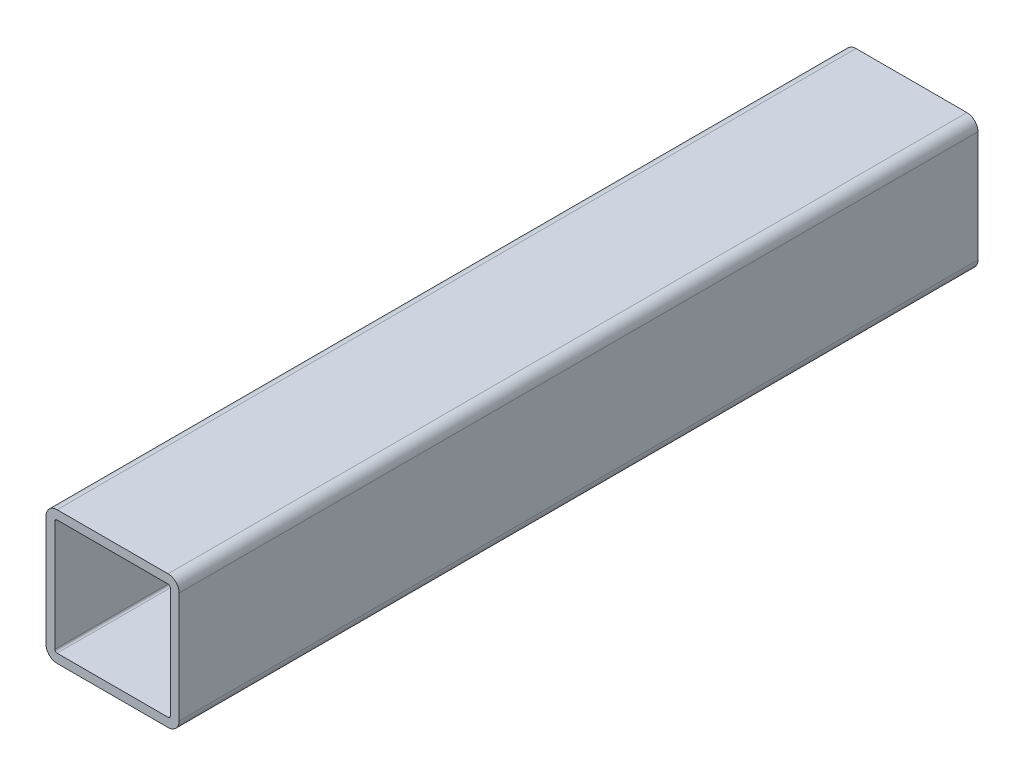
ISO-10303-21;
HEADER;
FILE_DESCRIPTION(('STEP AP214'),'2;1');
FILE_NAME('part.step','',(''),(''),'','','');
FILE_SCHEMA(('AUTOMOTIVE_DESIGN { 1 0 10303 214 1 1 1 1 }'));
ENDSEC;
DATA;
#1=APPLICATION_CONTEXT('core data for automotive mechanical design processes');
#2=APPLICATION_PROTOCOL_DEFINITION('international standard','automotive_design',2000,#1);
#3=PRODUCT_CONTEXT('',#1,'mechanical');
#4=PRODUCT('Part','Part','',(#3));
#5=PRODUCT_RELATED_PRODUCT_CATEGORY('part','',(#4));
#6=PRODUCT_DEFINITION_FORMATION('','',#4);
#7=PRODUCT_DEFINITION_CONTEXT('part definition',#1,'design');
#8=PRODUCT_DEFINITION('design','',#6,#7);
#9=PRODUCT_DEFINITION_SHAPE('','',#8);
#10=(LENGTH_UNIT() NAMED_UNIT(*) SI_UNIT(.MILLI.,.METRE.));
#11=(NAMED_UNIT(*) PLANE_ANGLE_UNIT() SI_UNIT($,.RADIAN.));
#12=(NAMED_UNIT(*) SI_UNIT($,.STERADIAN.) SOLID_ANGLE_UNIT());
#13=UNCERTAINTY_MEASURE_WITH_UNIT(LENGTH_MEASURE(1.E-05),#10,'distance_accuracy_value','');
#14=(GEOMETRIC_REPRESENTATION_CONTEXT(3) GLOBAL_UNCERTAINTY_ASSIGNED_CONTEXT((#13)) GLOBAL_UNIT_ASSIGNED_CONTEXT((#10,
#11,#12)) REPRESENTATION_CONTEXT('',''));
#15=CARTESIAN_POINT('',(0.,0.,0.));
#16=DIRECTION('',(0.,0.,1.));
#17=DIRECTION('',(1.,0.,0.));
#18=AXIS2_PLACEMENT_3D('',#15,#16,#17);
#19=CARTESIAN_POINT('',(-15.875,-15.875,114.3));
#20=DIRECTION('',(0.,0.,1.));
#21=DIRECTION('',(1.,0.,0.));
#22=AXIS2_PLACEMENT_3D('',#19,#20,#21);
#23=PLANE('',#22);
#24=CARTESIAN_POINT('',(-15.875,-15.875,114.3));
#25=DIRECTION('',(0.,0.,1.));
#26=DIRECTION('',(1.,0.,0.));
#27=AXIS2_PLACEMENT_3D('',#24,#25,#26);
#28=CIRCLE('',#27,3.175);
#29=CARTESIAN_POINT('',(-19.05,-15.875,114.3));
#30=VERTEX_POINT('',#29);
#31=CARTESIAN_POINT('',(-15.875,-19.05,114.3));
#32=VERTEX_POINT('',#31);
#33=EDGE_CURVE('E259',#30,#32,#28,.T.);
#34=ORIENTED_EDGE('',*,*,#33,.T.);
#35=DIRECTION('',(1.,0.,0.));
#36=VECTOR('',#35,1.);
#37=CARTESIAN_POINT('',(-15.875,-19.05,114.3));
#38=LINE('',#37,#36);
#39=CARTESIAN_POINT('',(15.875,-19.05,114.3));
#40=VERTEX_POINT('',#39);
#41=EDGE_CURVE('E262',#32,#40,#38,.T.);
#42=ORIENTED_EDGE('',*,*,#41,.T.);
#43=CARTESIAN_POINT('',(15.875,-15.875,114.3));
#44=DIRECTION('',(0.,0.,1.));
#45=DIRECTION('',(1.,0.,0.));
#46=AXIS2_PLACEMENT_3D('',#43,#44,#45);
#47=CIRCLE('',#46,3.175);
#48=CARTESIAN_POINT('',(19.05,-15.875,114.3));
#49=VERTEX_POINT('',#48);
#50=EDGE_CURVE('E265',#40,#49,#47,.T.);
#51=ORIENTED_EDGE('',*,*,#50,.T.);
#52=DIRECTION('',(0.,1.,0.));
#53=VECTOR('',#52,1.);
#54=CARTESIAN_POINT('',(19.05,15.875,114.3));
#55=LINE('',#54,#53);
#56=CARTESIAN_POINT('',(19.05,15.875,114.3));
#57=VERTEX_POINT('',#56);
#58=EDGE_CURVE('E267',#49,#57,#55,.T.);
#59=ORIENTED_EDGE('',*,*,#58,.T.);
#60=CARTESIAN_POINT('',(15.875,15.875,114.3));
#61=DIRECTION('',(0.,0.,1.));
#62=DIRECTION('',(1.,0.,0.));
#63=AXIS2_PLACEMENT_3D('',#60,#61,#62);
#64=CIRCLE('',#63,3.175);
#65=CARTESIAN_POINT('',(15.875,19.05,114.3));
#66=VERTEX_POINT('',#65);
#67=EDGE_CURVE('E269',#57,#66,#64,.T.);
#68=ORIENTED_EDGE('',*,*,#67,.T.);
#69=DIRECTION('',(-1.,0.,0.));
#70=VECTOR('',#69,1.);
#71=CARTESIAN_POINT('',(-15.875,19.05,114.3));
#72=LINE('',#71,#70);
#73=CARTESIAN_POINT('',(-15.875,19.05,114.3));
#74=VERTEX_POINT('',#73);
#75=EDGE_CURVE('E271',#66,#74,#72,.T.);
#76=ORIENTED_EDGE('',*,*,#75,.T.);
#77=CARTESIAN_POINT('',(-15.875,15.875,114.3));
#78=DIRECTION('',(0.,0.,1.));
#79=DIRECTION('',(1.,0.,0.));
#80=AXIS2_PLACEMENT_3D('',#77,#78,#79);
#81=CIRCLE('',#80,3.175);
#82=CARTESIAN_POINT('',(-19.05,15.875,114.3));
#83=VERTEX_POINT('',#82);
#84=EDGE_CURVE('E273',#74,#83,#81,.T.);
#85=ORIENTED_EDGE('',*,*,#84,.T.);
#86=DIRECTION('',(0.,-1.,0.));
#87=VECTOR('',#86,1.);
#88=CARTESIAN_POINT('',(-19.05,15.875,114.3));
#89=LINE('',#88,#87);
#90=EDGE_CURVE('E275',#83,#30,#89,.T.);
#91=ORIENTED_EDGE('',*,*,#90,.T.);
#92=EDGE_LOOP('',(#34,#42,#51,#59,#68,#76,#85,#91));
#93=FACE_BOUND('',#92,.T.);
#94=DIRECTION('',(1.,0.,0.));
#95=VECTOR('',#94,1.);
#96=CARTESIAN_POINT('',(-15.875,-16.51,114.3));
#97=LINE('',#96,#95);
#98=CARTESIAN_POINT('',(-15.875,-16.51,114.3));
#99=VERTEX_POINT('',#98);
#100=CARTESIAN_POINT('',(15.875,-16.51,114.3));
#101=VERTEX_POINT('',#100);
#102=EDGE_CURVE('E202',#99,#101,#97,.T.);
#103=ORIENTED_EDGE('',*,*,#102,.F.);
#104=CARTESIAN_POINT('',(-15.875,-15.875,114.3));
#105=DIRECTION('',(0.,0.,1.));
#106=DIRECTION('',(1.,0.,0.));
#107=AXIS2_PLACEMENT_3D('',#104,#105,#106);
#108=CIRCLE('',#107,0.635000000000002);
#109=CARTESIAN_POINT('',(-16.51,-15.875,114.3));
#110=VERTEX_POINT('',#109);
#111=EDGE_CURVE('E194',#110,#99,#108,.T.);
#112=ORIENTED_EDGE('',*,*,#111,.F.);
#113=DIRECTION('',(0.,-1.,0.));
#114=VECTOR('',#113,1.);
#115=CARTESIAN_POINT('',(-16.51,15.875,114.3));
#116=LINE('',#115,#114);
#117=CARTESIAN_POINT('',(-16.51,15.875,114.3));
#118=VERTEX_POINT('',#117);
#119=EDGE_CURVE('E227',#118,#110,#116,.T.);
#120=ORIENTED_EDGE('',*,*,#119,.F.);
#121=CARTESIAN_POINT('',(-15.875,15.875,114.3));
#122=DIRECTION('',(0.,0.,1.));
#123=DIRECTION('',(1.,0.,0.));
#124=AXIS2_PLACEMENT_3D('',#121,#122,#123);
#125=CIRCLE('',#124,0.635000000000004);
#126=CARTESIAN_POINT('',(-15.875,16.51,114.3));
#127=VERTEX_POINT('',#126);
#128=EDGE_CURVE('E225',#127,#118,#125,.T.);
#129=ORIENTED_EDGE('',*,*,#128,.F.);
#130=DIRECTION('',(-1.,0.,0.));
#131=VECTOR('',#130,1.);
#132=CARTESIAN_POINT('',(-15.875,16.51,114.3));
#133=LINE('',#132,#131);
#134=CARTESIAN_POINT('',(15.875,16.51,114.3));
#135=VERTEX_POINT('',#134);
#136=EDGE_CURVE('E223',#135,#127,#133,.T.);
#137=ORIENTED_EDGE('',*,*,#136,.F.);
#138=CARTESIAN_POINT('',(15.875,15.875,114.3));
#139=DIRECTION('',(0.,0.,1.));
#140=DIRECTION('',(1.,0.,0.));
#141=AXIS2_PLACEMENT_3D('',#138,#139,#140);
#142=CIRCLE('',#141,0.635000000000004);
#143=CARTESIAN_POINT('',(16.51,15.875,114.3));
#144=VERTEX_POINT('',#143);
#145=EDGE_CURVE('E221',#144,#135,#142,.T.);
#146=ORIENTED_EDGE('',*,*,#145,.F.);
#147=DIRECTION('',(0.,1.,0.));
#148=VECTOR('',#147,1.);
#149=CARTESIAN_POINT('',(16.51,15.875,114.3));
#150=LINE('',#149,#148);
#151=CARTESIAN_POINT('',(16.51,-15.875,114.3));
#152=VERTEX_POINT('',#151);
#153=EDGE_CURVE('E217',#152,#144,#150,.T.);
#154=ORIENTED_EDGE('',*,*,#153,.F.);
#155=CARTESIAN_POINT('',(15.875,-15.875,114.3));
#156=DIRECTION('',(0.,0.,1.));
#157=DIRECTION('',(1.,0.,0.));
#158=AXIS2_PLACEMENT_3D('',#155,#156,#157);
#159=CIRCLE('',#158,0.634999999999999);
#160=EDGE_CURVE('E215',#101,#152,#159,.T.);
#161=ORIENTED_EDGE('',*,*,#160,.F.);
#162=EDGE_LOOP('',(#103,#112,#120,#129,#137,#146,#154,#161));
#163=FACE_BOUND('',#162,.T.);
#164=ADVANCED_FACE('F81',(#93,#163),#23,.T.);
#165=CARTESIAN_POINT('',(-15.875,-15.875,-114.3));
#166=DIRECTION('',(0.,0.,1.));
#167=DIRECTION('',(1.,0.,0.));
#168=AXIS2_PLACEMENT_3D('',#165,#166,#167);
#169=PLANE('',#168);
#170=CARTESIAN_POINT('',(-15.875,-15.875,-114.3));
#171=DIRECTION('',(0.,0.,1.));
#172=DIRECTION('',(1.,0.,0.));
#173=AXIS2_PLACEMENT_3D('',#170,#171,#172);
#174=CIRCLE('',#173,3.175);
#175=CARTESIAN_POINT('',(-19.05,-15.875,-114.3));
#176=VERTEX_POINT('',#175);
#177=CARTESIAN_POINT('',(-15.875,-19.05,-114.3));
#178=VERTEX_POINT('',#177);
#179=EDGE_CURVE('E210',#176,#178,#174,.T.);
#180=ORIENTED_EDGE('',*,*,#179,.F.);
#181=DIRECTION('',(0.,-1.,0.));
#182=VECTOR('',#181,1.);
#183=CARTESIAN_POINT('',(-19.05,15.875,-114.3));
#184=LINE('',#183,#182);
#185=CARTESIAN_POINT('',(-19.05,15.875,-114.3));
#186=VERTEX_POINT('',#185);
#187=EDGE_CURVE('E263',#186,#176,#184,.T.);
#188=ORIENTED_EDGE('',*,*,#187,.F.);
#189=CARTESIAN_POINT('',(-15.875,15.875,-114.3));
#190=DIRECTION('',(0.,0.,1.));
#191=DIRECTION('',(1.,0.,0.));
#192=AXIS2_PLACEMENT_3D('',#189,#190,#191);
#193=CIRCLE('',#192,3.175);
#194=CARTESIAN_POINT('',(-15.875,19.05,-114.3));
#195=VERTEX_POINT('',#194);
#196=EDGE_CURVE('E290',#195,#186,#193,.T.);
#197=ORIENTED_EDGE('',*,*,#196,.F.);
#198=DIRECTION('',(-1.,0.,0.));
#199=VECTOR('',#198,1.);
#200=CARTESIAN_POINT('',(-15.875,19.05,-114.3));
#201=LINE('',#200,#199);
#202=CARTESIAN_POINT('',(15.875,19.05,-114.3));
#203=VERTEX_POINT('',#202);
#204=EDGE_CURVE('E288',#203,#195,#201,.T.);
#205=ORIENTED_EDGE('',*,*,#204,.F.);
#206=CARTESIAN_POINT('',(15.875,15.875,-114.3));
#207=DIRECTION('',(0.,0.,1.));
#208=DIRECTION('',(1.,0.,0.));
#209=AXIS2_PLACEMENT_3D('',#206,#207,#208);
#210=CIRCLE('',#209,3.175);
#211=CARTESIAN_POINT('',(19.05,15.875,-114.3));
#212=VERTEX_POINT('',#211);
#213=EDGE_CURVE('E286',#212,#203,#210,.T.);
#214=ORIENTED_EDGE('',*,*,#213,.F.);
#215=DIRECTION('',(0.,1.,0.));
#216=VECTOR('',#215,1.);
#217=CARTESIAN_POINT('',(19.05,15.875,-114.3));
#218=LINE('',#217,#216);
#219=CARTESIAN_POINT('',(19.05,-15.875,-114.3));
#220=VERTEX_POINT('',#219);
#221=EDGE_CURVE('E284',#220,#212,#218,.T.);
#222=ORIENTED_EDGE('',*,*,#221,.F.);
#223=CARTESIAN_POINT('',(15.875,-15.875,-114.3));
#224=DIRECTION('',(0.,0.,1.));
#225=DIRECTION('',(1.,0.,0.));
#226=AXIS2_PLACEMENT_3D('',#223,#224,#225);
#227=CIRCLE('',#226,3.175);
#228=CARTESIAN_POINT('',(15.875,-19.05,-114.3));
#229=VERTEX_POINT('',#228);
#230=EDGE_CURVE('E282',#229,#220,#227,.T.);
#231=ORIENTED_EDGE('',*,*,#230,.F.);
#232=DIRECTION('',(1.,0.,0.));
#233=VECTOR('',#232,1.);
#234=CARTESIAN_POINT('',(-15.875,-19.05,-114.3));
#235=LINE('',#234,#233);
#236=EDGE_CURVE('E280',#178,#229,#235,.T.);
#237=ORIENTED_EDGE('',*,*,#236,.F.);
#238=EDGE_LOOP('',(#180,#188,#197,#205,#214,#222,#231,#237));
#239=FACE_BOUND('',#238,.T.);
#240=CARTESIAN_POINT('',(-15.875,-15.875,-114.3));
#241=DIRECTION('',(0.,0.,1.));
#242=DIRECTION('',(1.,0.,0.));
#243=AXIS2_PLACEMENT_3D('',#240,#241,#242);
#244=CIRCLE('',#243,0.635000000000002);
#245=CARTESIAN_POINT('',(-16.51,-15.875,-114.3));
#246=VERTEX_POINT('',#245);
#247=CARTESIAN_POINT('',(-15.875,-16.51,-114.3));
#248=VERTEX_POINT('',#247);
#249=EDGE_CURVE('E104',#246,#248,#244,.T.);
#250=ORIENTED_EDGE('',*,*,#249,.T.);
#251=DIRECTION('',(1.,0.,0.));
#252=VECTOR('',#251,1.);
#253=CARTESIAN_POINT('',(-15.875,-16.51,-114.3));
#254=LINE('',#253,#252);
#255=CARTESIAN_POINT('',(15.875,-16.51,-114.3));
#256=VERTEX_POINT('',#255);
#257=EDGE_CURVE('E209',#248,#256,#254,.T.);
#258=ORIENTED_EDGE('',*,*,#257,.T.);
#259=CARTESIAN_POINT('',(15.875,-15.875,-114.3));
#260=DIRECTION('',(0.,0.,1.));
#261=DIRECTION('',(1.,0.,0.));
#262=AXIS2_PLACEMENT_3D('',#259,#260,#261);
#263=CIRCLE('',#262,0.634999999999999);
#264=CARTESIAN_POINT('',(16.51,-15.875,-114.3));
#265=VERTEX_POINT('',#264);
#266=EDGE_CURVE('E231',#256,#265,#263,.T.);
#267=ORIENTED_EDGE('',*,*,#266,.T.);
#268=DIRECTION('',(0.,1.,0.));
#269=VECTOR('',#268,1.);
#270=CARTESIAN_POINT('',(16.51,15.875,-114.3));
#271=LINE('',#270,#269);
#272=CARTESIAN_POINT('',(16.51,15.875,-114.3));
#273=VERTEX_POINT('',#272);
#274=EDGE_CURVE('E234',#265,#273,#271,.T.);
#275=ORIENTED_EDGE('',*,*,#274,.T.);
#276=CARTESIAN_POINT('',(15.875,15.875,-114.3));
#277=DIRECTION('',(0.,0.,1.));
#278=DIRECTION('',(1.,0.,0.));
#279=AXIS2_PLACEMENT_3D('',#276,#277,#278);
#280=CIRCLE('',#279,0.635000000000004);
#281=CARTESIAN_POINT('',(15.875,16.51,-114.3));
#282=VERTEX_POINT('',#281);
#283=EDGE_CURVE('E237',#273,#282,#280,.T.);
#284=ORIENTED_EDGE('',*,*,#283,.T.);
#285=DIRECTION('',(-1.,0.,0.));
#286=VECTOR('',#285,1.);
#287=CARTESIAN_POINT('',(-15.875,16.51,-114.3));
#288=LINE('',#287,#286);
#289=CARTESIAN_POINT('',(-15.875,16.51,-114.3));
#290=VERTEX_POINT('',#289);
#291=EDGE_CURVE('E240',#282,#290,#288,.T.);
#292=ORIENTED_EDGE('',*,*,#291,.T.);
#293=CARTESIAN_POINT('',(-15.875,15.875,-114.3));
#294=DIRECTION('',(0.,0.,1.));
#295=DIRECTION('',(1.,0.,0.));
#296=AXIS2_PLACEMENT_3D('',#293,#294,#295);
#297=CIRCLE('',#296,0.635000000000004);
#298=CARTESIAN_POINT('',(-16.51,15.875,-114.3));
#299=VERTEX_POINT('',#298);
#300=EDGE_CURVE('E243',#290,#299,#297,.T.);
#301=ORIENTED_EDGE('',*,*,#300,.T.);
#302=DIRECTION('',(0.,-1.,0.));
#303=VECTOR('',#302,1.);
#304=CARTESIAN_POINT('',(-16.51,15.875,-114.3));
#305=LINE('',#304,#303);
#306=EDGE_CURVE('E203',#299,#246,#305,.T.);
#307=ORIENTED_EDGE('',*,*,#306,.T.);
#308=EDGE_LOOP('',(#250,#258,#267,#275,#284,#292,#301,#307));
#309=FACE_BOUND('',#308,.T.);
#310=ADVANCED_FACE('F320',(#239,#309),#169,.F.);
#311=CARTESIAN_POINT('',(-15.875,-15.875,114.3));
#312=DIRECTION('',(0.,0.,-1.));
#313=DIRECTION('',(-1.,0.,0.));
#314=AXIS2_PLACEMENT_3D('',#311,#312,#313);
#315=CYLINDRICAL_SURFACE('',#314,3.175);
#316=ORIENTED_EDGE('',*,*,#179,.T.);
#317=DIRECTION('',(0.,0.,-1.));
#318=VECTOR('',#317,1.);
#319=CARTESIAN_POINT('',(-15.875,-19.05,114.3));
#320=LINE('',#319,#318);
#321=EDGE_CURVE('E12',#32,#178,#320,.T.);
#322=ORIENTED_EDGE('',*,*,#321,.F.);
#323=ORIENTED_EDGE('',*,*,#33,.F.);
#324=DIRECTION('',(0.,0.,-1.));
#325=VECTOR('',#324,1.);
#326=CARTESIAN_POINT('',(-19.05,-15.875,114.3));
#327=LINE('',#326,#325);
#328=EDGE_CURVE('E277',#30,#176,#327,.T.);
#329=ORIENTED_EDGE('',*,*,#328,.T.);
#330=EDGE_LOOP('',(#316,#322,#323,#329));
#331=FACE_BOUND('',#330,.T.);
#332=ADVANCED_FACE('F83',(#331),#315,.T.);
#333=CARTESIAN_POINT('',(-15.875,-19.05,114.3));
#334=DIRECTION('',(0.,1.,0.));
#335=DIRECTION('',(0.,0.,1.));
#336=AXIS2_PLACEMENT_3D('',#333,#334,#335);
#337=PLANE('',#336);
#338=ORIENTED_EDGE('',*,*,#236,.T.);
#339=DIRECTION('',(0.,0.,-1.));
#340=VECTOR('',#339,1.);
#341=CARTESIAN_POINT('',(15.875,-19.05,114.3));
#342=LINE('',#341,#340);
#343=EDGE_CURVE('E89',#40,#229,#342,.T.);
#344=ORIENTED_EDGE('',*,*,#343,.F.);
#345=ORIENTED_EDGE('',*,*,#41,.F.);
#346=ORIENTED_EDGE('',*,*,#321,.T.);
#347=EDGE_LOOP('',(#338,#344,#345,#346));
#348=FACE_BOUND('',#347,.T.);
#349=ADVANCED_FACE('F337',(#348),#337,.F.);
#350=CARTESIAN_POINT('',(15.875,-15.875,114.3));
#351=DIRECTION('',(0.,0.,-1.));
#352=DIRECTION('',(-1.,0.,0.));
#353=AXIS2_PLACEMENT_3D('',#350,#351,#352);
#354=CYLINDRICAL_SURFACE('',#353,3.175);
#355=ORIENTED_EDGE('',*,*,#230,.T.);
#356=DIRECTION('',(0.,0.,-1.));
#357=VECTOR('',#356,1.);
#358=CARTESIAN_POINT('',(19.05,-15.875,114.3));
#359=LINE('',#358,#357);
#360=EDGE_CURVE('E307',#49,#220,#359,.T.);
#361=ORIENTED_EDGE('',*,*,#360,.F.);
#362=ORIENTED_EDGE('',*,*,#50,.F.);
#363=ORIENTED_EDGE('',*,*,#343,.T.);
#364=EDGE_LOOP('',(#355,#361,#362,#363));
#365=FACE_BOUND('',#364,.T.);
#366=ADVANCED_FACE('F314',(#365),#354,.T.);
#367=CARTESIAN_POINT('',(19.05,15.875,114.3));
#368=DIRECTION('',(-1.,0.,0.));
#369=DIRECTION('',(0.,-1.,0.));
#370=AXIS2_PLACEMENT_3D('',#367,#368,#369);
#371=PLANE('',#370);
#372=ORIENTED_EDGE('',*,*,#221,.T.);
#373=DIRECTION('',(0.,0.,-1.));
#374=VECTOR('',#373,1.);
#375=CARTESIAN_POINT('',(19.05,15.875,114.3));
#376=LINE('',#375,#374);
#377=EDGE_CURVE('E304',#57,#212,#376,.T.);
#378=ORIENTED_EDGE('',*,*,#377,.F.);
#379=ORIENTED_EDGE('',*,*,#58,.F.);
#380=ORIENTED_EDGE('',*,*,#360,.T.);
#381=EDGE_LOOP('',(#372,#378,#379,#380));
#382=FACE_BOUND('',#381,.T.);
#383=ADVANCED_FACE('F326',(#382),#371,.F.);
#384=CARTESIAN_POINT('',(15.875,15.875,114.3));
#385=DIRECTION('',(0.,0.,-1.));
#386=DIRECTION('',(-1.,0.,0.));
#387=AXIS2_PLACEMENT_3D('',#384,#385,#386);
#388=CYLINDRICAL_SURFACE('',#387,3.175);
#389=ORIENTED_EDGE('',*,*,#213,.T.);
#390=DIRECTION('',(0.,0.,-1.));
#391=VECTOR('',#390,1.);
#392=CARTESIAN_POINT('',(15.875,19.05,114.3));
#393=LINE('',#392,#391);
#394=EDGE_CURVE('E301',#66,#203,#393,.T.);
#395=ORIENTED_EDGE('',*,*,#394,.F.);
#396=ORIENTED_EDGE('',*,*,#67,.F.);
#397=ORIENTED_EDGE('',*,*,#377,.T.);
#398=EDGE_LOOP('',(#389,#395,#396,#397));
#399=FACE_BOUND('',#398,.T.);
#400=ADVANCED_FACE('F330',(#399),#388,.T.);
#401=CARTESIAN_POINT('',(-15.875,19.05,114.3));
#402=DIRECTION('',(0.,-1.,0.));
#403=DIRECTION('',(0.,0.,-1.));
#404=AXIS2_PLACEMENT_3D('',#401,#402,#403);
#405=PLANE('',#404);
#406=ORIENTED_EDGE('',*,*,#204,.T.);
#407=DIRECTION('',(0.,0.,-1.));
#408=VECTOR('',#407,1.);
#409=CARTESIAN_POINT('',(-15.875,19.05,114.3));
#410=LINE('',#409,#408);
#411=EDGE_CURVE('E298',#74,#195,#410,.T.);
#412=ORIENTED_EDGE('',*,*,#411,.F.);
#413=ORIENTED_EDGE('',*,*,#75,.F.);
#414=ORIENTED_EDGE('',*,*,#394,.T.);
#415=EDGE_LOOP('',(#406,#412,#413,#414));
#416=FACE_BOUND('',#415,.T.);
#417=ADVANCED_FACE('F350',(#416),#405,.F.);
#418=CARTESIAN_POINT('',(-15.875,15.875,114.3));
#419=DIRECTION('',(0.,0.,-1.));
#420=DIRECTION('',(-1.,0.,0.));
#421=AXIS2_PLACEMENT_3D('',#418,#419,#420);
#422=CYLINDRICAL_SURFACE('',#421,3.175);
#423=ORIENTED_EDGE('',*,*,#196,.T.);
#424=DIRECTION('',(0.,0.,-1.));
#425=VECTOR('',#424,1.);
#426=CARTESIAN_POINT('',(-19.05,15.875,114.3));
#427=LINE('',#426,#425);
#428=EDGE_CURVE('E295',#83,#186,#427,.T.);
#429=ORIENTED_EDGE('',*,*,#428,.F.);
#430=ORIENTED_EDGE('',*,*,#84,.F.);
#431=ORIENTED_EDGE('',*,*,#411,.T.);
#432=EDGE_LOOP('',(#423,#429,#430,#431));
#433=FACE_BOUND('',#432,.T.);
#434=ADVANCED_FACE('F348',(#433),#422,.T.);
#435=CARTESIAN_POINT('',(-19.05,15.875,114.3));
#436=DIRECTION('',(1.,0.,0.));
#437=DIRECTION('',(0.,1.,0.));
#438=AXIS2_PLACEMENT_3D('',#435,#436,#437);
#439=PLANE('',#438);
#440=ORIENTED_EDGE('',*,*,#187,.T.);
#441=ORIENTED_EDGE('',*,*,#328,.F.);
#442=ORIENTED_EDGE('',*,*,#90,.F.);
#443=ORIENTED_EDGE('',*,*,#428,.T.);
#444=EDGE_LOOP('',(#440,#441,#442,#443));
#445=FACE_BOUND('',#444,.T.);
#446=ADVANCED_FACE('F343',(#445),#439,.F.);
#447=CARTESIAN_POINT('',(-15.875,-15.875,114.3));
#448=DIRECTION('',(0.,0.,-1.));
#449=DIRECTION('',(-1.,0.,0.));
#450=AXIS2_PLACEMENT_3D('',#447,#448,#449);
#451=CYLINDRICAL_SURFACE('',#450,0.635000000000002);
#452=ORIENTED_EDGE('',*,*,#249,.F.);
#453=DIRECTION('',(0.,0.,-1.));
#454=VECTOR('',#453,1.);
#455=CARTESIAN_POINT('',(-16.51,-15.875,114.3));
#456=LINE('',#455,#454);
#457=EDGE_CURVE('E198',#110,#246,#456,.T.);
#458=ORIENTED_EDGE('',*,*,#457,.F.);
#459=ORIENTED_EDGE('',*,*,#111,.T.);
#460=DIRECTION('',(0.,0.,-1.));
#461=VECTOR('',#460,1.);
#462=CARTESIAN_POINT('',(-15.875,-16.51,114.3));
#463=LINE('',#462,#461);
#464=EDGE_CURVE('E197',#99,#248,#463,.T.);
#465=ORIENTED_EDGE('',*,*,#464,.T.);
#466=EDGE_LOOP('',(#452,#458,#459,#465));
#467=FACE_BOUND('',#466,.T.);
#468=ADVANCED_FACE('F196',(#467),#451,.F.);
#469=CARTESIAN_POINT('',(-15.875,-16.51,114.3));
#470=DIRECTION('',(0.,1.,0.));
#471=DIRECTION('',(0.,0.,1.));
#472=AXIS2_PLACEMENT_3D('',#469,#470,#471);
#473=PLANE('',#472);
#474=ORIENTED_EDGE('',*,*,#257,.F.);
#475=ORIENTED_EDGE('',*,*,#464,.F.);
#476=ORIENTED_EDGE('',*,*,#102,.T.);
#477=DIRECTION('',(0.,0.,-1.));
#478=VECTOR('',#477,1.);
#479=CARTESIAN_POINT('',(15.875,-16.51,114.3));
#480=LINE('',#479,#478);
#481=EDGE_CURVE('E211',#101,#256,#480,.T.);
#482=ORIENTED_EDGE('',*,*,#481,.T.);
#483=EDGE_LOOP('',(#474,#475,#476,#482));
#484=FACE_BOUND('',#483,.T.);
#485=ADVANCED_FACE('F206',(#484),#473,.T.);
#486=CARTESIAN_POINT('',(15.875,-15.875,114.3));
#487=DIRECTION('',(0.,0.,-1.));
#488=DIRECTION('',(-1.,0.,0.));
#489=AXIS2_PLACEMENT_3D('',#486,#487,#488);
#490=CYLINDRICAL_SURFACE('',#489,0.634999999999999);
#491=ORIENTED_EDGE('',*,*,#266,.F.);
#492=ORIENTED_EDGE('',*,*,#481,.F.);
#493=ORIENTED_EDGE('',*,*,#160,.T.);
#494=DIRECTION('',(0.,0.,-1.));
#495=VECTOR('',#494,1.);
#496=CARTESIAN_POINT('',(16.51,-15.875,114.3));
#497=LINE('',#496,#495);
#498=EDGE_CURVE('E256',#152,#265,#497,.T.);
#499=ORIENTED_EDGE('',*,*,#498,.T.);
#500=EDGE_LOOP('',(#491,#492,#493,#499));
#501=FACE_BOUND('',#500,.T.);
#502=ADVANCED_FACE('F375',(#501),#490,.F.);
#503=CARTESIAN_POINT('',(16.51,15.875,114.3));
#504=DIRECTION('',(-1.,0.,0.));
#505=DIRECTION('',(0.,-1.,0.));
#506=AXIS2_PLACEMENT_3D('',#503,#504,#505);
#507=PLANE('',#506);
#508=ORIENTED_EDGE('',*,*,#274,.F.);
#509=ORIENTED_EDGE('',*,*,#498,.F.);
#510=ORIENTED_EDGE('',*,*,#153,.T.);
#511=DIRECTION('',(0.,0.,-1.));
#512=VECTOR('',#511,1.);
#513=CARTESIAN_POINT('',(16.51,15.875,114.3));
#514=LINE('',#513,#512);
#515=EDGE_CURVE('E254',#144,#273,#514,.T.);
#516=ORIENTED_EDGE('',*,*,#515,.T.);
#517=EDGE_LOOP('',(#508,#509,#510,#516));
#518=FACE_BOUND('',#517,.T.);
#519=ADVANCED_FACE('F379',(#518),#507,.T.);
#520=CARTESIAN_POINT('',(15.875,15.875,114.3));
#521=DIRECTION('',(0.,0.,-1.));
#522=DIRECTION('',(-1.,0.,0.));
#523=AXIS2_PLACEMENT_3D('',#520,#521,#522);
#524=CYLINDRICAL_SURFACE('',#523,0.635000000000004);
#525=ORIENTED_EDGE('',*,*,#283,.F.);
#526=ORIENTED_EDGE('',*,*,#515,.F.);
#527=ORIENTED_EDGE('',*,*,#145,.T.);
#528=DIRECTION('',(0.,0.,-1.));
#529=VECTOR('',#528,1.);
#530=CARTESIAN_POINT('',(15.875,16.51,114.3));
#531=LINE('',#530,#529);
#532=EDGE_CURVE('E252',#135,#282,#531,.T.);
#533=ORIENTED_EDGE('',*,*,#532,.T.);
#534=EDGE_LOOP('',(#525,#526,#527,#533));
#535=FACE_BOUND('',#534,.T.);
#536=ADVANCED_FACE('F385',(#535),#524,.F.);
#537=CARTESIAN_POINT('',(-15.875,16.51,114.3));
#538=DIRECTION('',(0.,-1.,0.));
#539=DIRECTION('',(0.,0.,-1.));
#540=AXIS2_PLACEMENT_3D('',#537,#538,#539);
#541=PLANE('',#540);
#542=ORIENTED_EDGE('',*,*,#291,.F.);
#543=ORIENTED_EDGE('',*,*,#532,.F.);
#544=ORIENTED_EDGE('',*,*,#136,.T.);
#545=DIRECTION('',(0.,0.,-1.));
#546=VECTOR('',#545,1.);
#547=CARTESIAN_POINT('',(-15.875,16.51,114.3));
#548=LINE('',#547,#546);
#549=EDGE_CURVE('E250',#127,#290,#548,.T.);
#550=ORIENTED_EDGE('',*,*,#549,.T.);
#551=EDGE_LOOP('',(#542,#543,#544,#550));
#552=FACE_BOUND('',#551,.T.);
#553=ADVANCED_FACE('F389',(#552),#541,.T.);
#554=CARTESIAN_POINT('',(-15.875,15.875,114.3));
#555=DIRECTION('',(0.,0.,-1.));
#556=DIRECTION('',(-1.,0.,0.));
#557=AXIS2_PLACEMENT_3D('',#554,#555,#556);
#558=CYLINDRICAL_SURFACE('',#557,0.635000000000004);
#559=ORIENTED_EDGE('',*,*,#300,.F.);
#560=ORIENTED_EDGE('',*,*,#549,.F.);
#561=ORIENTED_EDGE('',*,*,#128,.T.);
#562=DIRECTION('',(0.,0.,-1.));
#563=VECTOR('',#562,1.);
#564=CARTESIAN_POINT('',(-16.51,15.875,114.3));
#565=LINE('',#564,#563);
#566=EDGE_CURVE('E96',#118,#299,#565,.T.);
#567=ORIENTED_EDGE('',*,*,#566,.T.);
#568=EDGE_LOOP('',(#559,#560,#561,#567));
#569=FACE_BOUND('',#568,.T.);
#570=ADVANCED_FACE('F393',(#569),#558,.F.);
#571=CARTESIAN_POINT('',(-16.51,15.875,114.3));
#572=DIRECTION('',(1.,0.,0.));
#573=DIRECTION('',(0.,1.,0.));
#574=AXIS2_PLACEMENT_3D('',#571,#572,#573);
#575=PLANE('',#574);
#576=ORIENTED_EDGE('',*,*,#306,.F.);
#577=ORIENTED_EDGE('',*,*,#566,.F.);
#578=ORIENTED_EDGE('',*,*,#119,.T.);
#579=ORIENTED_EDGE('',*,*,#457,.T.);
#580=EDGE_LOOP('',(#576,#577,#578,#579));
#581=FACE_BOUND('',#580,.T.);
#582=ADVANCED_FACE('F397',(#581),#575,.T.);
#583=CLOSED_SHELL('',(#164,#310,#332,#349,#366,#383,#400,#417,#434,#446,#468,#485,#502,#519,
#536,#553,#570,#582));
#584=MANIFOLD_SOLID_BREP('B2',#583);
#585=ADVANCED_BREP_SHAPE_REPRESENTATION('',(#18,#584),#14);
#586=SHAPE_DEFINITION_REPRESENTATION(#9,#585);
ENDSEC;
END-ISO-10303-21;
